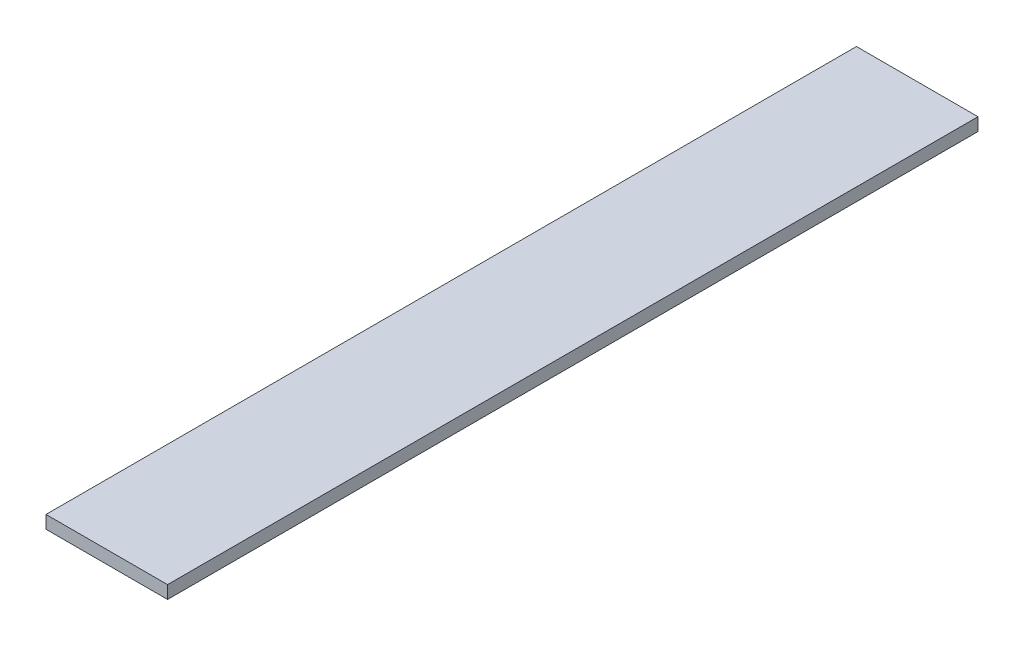
ISO-10303-21;
HEADER;
FILE_DESCRIPTION(('STEP AP214'),'2;1');
FILE_NAME('part.step','',(''),(''),'','','');
FILE_SCHEMA(('AUTOMOTIVE_DESIGN { 1 0 10303 214 1 1 1 1 }'));
ENDSEC;
DATA;
#1=APPLICATION_CONTEXT('core data for automotive mechanical design processes');
#2=APPLICATION_PROTOCOL_DEFINITION('international standard','automotive_design',2000,#1);
#3=PRODUCT_CONTEXT('',#1,'mechanical');
#4=PRODUCT('Part','Part','',(#3));
#5=PRODUCT_RELATED_PRODUCT_CATEGORY('part','',(#4));
#6=PRODUCT_DEFINITION_FORMATION('','',#4);
#7=PRODUCT_DEFINITION_CONTEXT('part definition',#1,'design');
#8=PRODUCT_DEFINITION('design','',#6,#7);
#9=PRODUCT_DEFINITION_SHAPE('','',#8);
#10=(LENGTH_UNIT() NAMED_UNIT(*) SI_UNIT(.MILLI.,.METRE.));
#11=(NAMED_UNIT(*) PLANE_ANGLE_UNIT() SI_UNIT($,.RADIAN.));
#12=(NAMED_UNIT(*) SI_UNIT($,.STERADIAN.) SOLID_ANGLE_UNIT());
#13=UNCERTAINTY_MEASURE_WITH_UNIT(LENGTH_MEASURE(1.E-05),#10,'distance_accuracy_value','');
#14=(GEOMETRIC_REPRESENTATION_CONTEXT(3) GLOBAL_UNCERTAINTY_ASSIGNED_CONTEXT((#13)) GLOBAL_UNIT_ASSIGNED_CONTEXT((#10,
#11,#12)) REPRESENTATION_CONTEXT('',''));
#15=CARTESIAN_POINT('',(0.,0.,0.));
#16=DIRECTION('',(0.,0.,1.));
#17=DIRECTION('',(1.,0.,0.));
#18=AXIS2_PLACEMENT_3D('',#15,#16,#17);
#19=CARTESIAN_POINT('',(0.,3.175,0.));
#20=DIRECTION('',(1.,0.,0.));
#21=DIRECTION('',(0.,0.,-1.));
#22=AXIS2_PLACEMENT_3D('',#19,#20,#21);
#23=PLANE('',#22);
#24=DIRECTION('',(0.,0.,1.));
#25=VECTOR('',#24,1.);
#26=CARTESIAN_POINT('',(0.,0.,0.));
#27=LINE('',#26,#25);
#28=CARTESIAN_POINT('',(0.,0.,-200.));
#29=VERTEX_POINT('',#28);
#30=CARTESIAN_POINT('',(0.,0.,0.));
#31=VERTEX_POINT('',#30);
#32=EDGE_CURVE('E96',#29,#31,#27,.T.);
#33=ORIENTED_EDGE('',*,*,#32,.T.);
#34=DIRECTION('',(0.,-1.,0.));
#35=VECTOR('',#34,1.);
#36=CARTESIAN_POINT('',(0.,3.175,0.));
#37=LINE('',#36,#35);
#38=CARTESIAN_POINT('',(0.,3.175,0.));
#39=VERTEX_POINT('',#38);
#40=EDGE_CURVE('E11',#39,#31,#37,.T.);
#41=ORIENTED_EDGE('',*,*,#40,.F.);
#42=DIRECTION('',(0.,0.,1.));
#43=VECTOR('',#42,1.);
#44=CARTESIAN_POINT('',(0.,3.175,0.));
#45=LINE('',#44,#43);
#46=CARTESIAN_POINT('',(0.,3.175,-200.));
#47=VERTEX_POINT('',#46);
#48=EDGE_CURVE('E84',#47,#39,#45,.T.);
#49=ORIENTED_EDGE('',*,*,#48,.F.);
#50=DIRECTION('',(0.,-1.,0.));
#51=VECTOR('',#50,1.);
#52=CARTESIAN_POINT('',(0.,3.175,-200.));
#53=LINE('',#52,#51);
#54=EDGE_CURVE('E92',#47,#29,#53,.T.);
#55=ORIENTED_EDGE('',*,*,#54,.T.);
#56=EDGE_LOOP('',(#33,#41,#49,#55));
#57=FACE_BOUND('',#56,.T.);
#58=ADVANCED_FACE('F33',(#57),#23,.F.);
#59=CARTESIAN_POINT('',(0.,3.175,0.));
#60=DIRECTION('',(0.,0.,-1.));
#61=DIRECTION('',(-1.,0.,0.));
#62=AXIS2_PLACEMENT_3D('',#59,#60,#61);
#63=PLANE('',#62);
#64=DIRECTION('',(1.,0.,0.));
#65=VECTOR('',#64,1.);
#66=CARTESIAN_POINT('',(0.,0.,0.));
#67=LINE('',#66,#65);
#68=CARTESIAN_POINT('',(30.,0.,0.));
#69=VERTEX_POINT('',#68);
#70=EDGE_CURVE('E88',#31,#69,#67,.T.);
#71=ORIENTED_EDGE('',*,*,#70,.T.);
#72=DIRECTION('',(0.,-1.,0.));
#73=VECTOR('',#72,1.);
#74=CARTESIAN_POINT('',(30.,3.175,0.));
#75=LINE('',#74,#73);
#76=CARTESIAN_POINT('',(30.,3.175,0.));
#77=VERTEX_POINT('',#76);
#78=EDGE_CURVE('E41',#77,#69,#75,.T.);
#79=ORIENTED_EDGE('',*,*,#78,.F.);
#80=DIRECTION('',(1.,0.,0.));
#81=VECTOR('',#80,1.);
#82=CARTESIAN_POINT('',(0.,3.175,0.));
#83=LINE('',#82,#81);
#84=EDGE_CURVE('E79',#39,#77,#83,.T.);
#85=ORIENTED_EDGE('',*,*,#84,.F.);
#86=ORIENTED_EDGE('',*,*,#40,.T.);
#87=EDGE_LOOP('',(#71,#79,#85,#86));
#88=FACE_BOUND('',#87,.T.);
#89=ADVANCED_FACE('F87',(#88),#63,.F.);
#90=CARTESIAN_POINT('',(30.,3.175,0.));
#91=DIRECTION('',(-1.,0.,0.));
#92=DIRECTION('',(0.,0.,1.));
#93=AXIS2_PLACEMENT_3D('',#90,#91,#92);
#94=PLANE('',#93);
#95=DIRECTION('',(0.,0.,-1.));
#96=VECTOR('',#95,1.);
#97=CARTESIAN_POINT('',(30.,0.,0.));
#98=LINE('',#97,#96);
#99=CARTESIAN_POINT('',(30.,0.,-200.));
#100=VERTEX_POINT('',#99);
#101=EDGE_CURVE('E66',#69,#100,#98,.T.);
#102=ORIENTED_EDGE('',*,*,#101,.T.);
#103=DIRECTION('',(0.,-1.,0.));
#104=VECTOR('',#103,1.);
#105=CARTESIAN_POINT('',(30.,3.175,-200.));
#106=LINE('',#105,#104);
#107=CARTESIAN_POINT('',(30.,3.175,-200.));
#108=VERTEX_POINT('',#107);
#109=EDGE_CURVE('E89',#108,#100,#106,.T.);
#110=ORIENTED_EDGE('',*,*,#109,.F.);
#111=DIRECTION('',(0.,0.,-1.));
#112=VECTOR('',#111,1.);
#113=CARTESIAN_POINT('',(30.,3.175,0.));
#114=LINE('',#113,#112);
#115=EDGE_CURVE('E82',#77,#108,#114,.T.);
#116=ORIENTED_EDGE('',*,*,#115,.F.);
#117=ORIENTED_EDGE('',*,*,#78,.T.);
#118=EDGE_LOOP('',(#102,#110,#116,#117));
#119=FACE_BOUND('',#118,.T.);
#120=ADVANCED_FACE('F90',(#119),#94,.F.);
#121=CARTESIAN_POINT('',(0.,3.175,-200.));
#122=DIRECTION('',(0.,0.,1.));
#123=DIRECTION('',(1.,0.,0.));
#124=AXIS2_PLACEMENT_3D('',#121,#122,#123);
#125=PLANE('',#124);
#126=DIRECTION('',(-1.,0.,0.));
#127=VECTOR('',#126,1.);
#128=CARTESIAN_POINT('',(0.,0.,-200.));
#129=LINE('',#128,#127);
#130=EDGE_CURVE('E72',#100,#29,#129,.T.);
#131=ORIENTED_EDGE('',*,*,#130,.T.);
#132=ORIENTED_EDGE('',*,*,#54,.F.);
#133=DIRECTION('',(-1.,0.,0.));
#134=VECTOR('',#133,1.);
#135=CARTESIAN_POINT('',(0.,3.175,-200.));
#136=LINE('',#135,#134);
#137=EDGE_CURVE('E49',#108,#47,#136,.T.);
#138=ORIENTED_EDGE('',*,*,#137,.F.);
#139=ORIENTED_EDGE('',*,*,#109,.T.);
#140=EDGE_LOOP('',(#131,#132,#138,#139));
#141=FACE_BOUND('',#140,.T.);
#142=ADVANCED_FACE('F103',(#141),#125,.F.);
#143=CARTESIAN_POINT('',(0.,3.175,0.));
#144=DIRECTION('',(0.,-1.,0.));
#145=DIRECTION('',(0.,0.,-1.));
#146=AXIS2_PLACEMENT_3D('',#143,#144,#145);
#147=PLANE('',#146);
#148=ORIENTED_EDGE('',*,*,#48,.T.);
#149=ORIENTED_EDGE('',*,*,#84,.T.);
#150=ORIENTED_EDGE('',*,*,#115,.T.);
#151=ORIENTED_EDGE('',*,*,#137,.T.);
#152=EDGE_LOOP('',(#148,#149,#150,#151));
#153=FACE_BOUND('',#152,.T.);
#154=ADVANCED_FACE('F80',(#153),#147,.F.);
#155=CARTESIAN_POINT('',(0.,0.,0.));
#156=DIRECTION('',(0.,-1.,0.));
#157=DIRECTION('',(0.,0.,-1.));
#158=AXIS2_PLACEMENT_3D('',#155,#156,#157);
#159=PLANE('',#158);
#160=ORIENTED_EDGE('',*,*,#32,.F.);
#161=ORIENTED_EDGE('',*,*,#130,.F.);
#162=ORIENTED_EDGE('',*,*,#101,.F.);
#163=ORIENTED_EDGE('',*,*,#70,.F.);
#164=EDGE_LOOP('',(#160,#161,#162,#163));
#165=FACE_BOUND('',#164,.T.);
#166=ADVANCED_FACE('F106',(#165),#159,.T.);
#167=CLOSED_SHELL('',(#58,#89,#120,#142,#154,#166));
#168=MANIFOLD_SOLID_BREP('B2',#167);
#169=ADVANCED_BREP_SHAPE_REPRESENTATION('',(#18,#168),#14);
#170=SHAPE_DEFINITION_REPRESENTATION(#9,#169);
ENDSEC;
END-ISO-10303-21;
